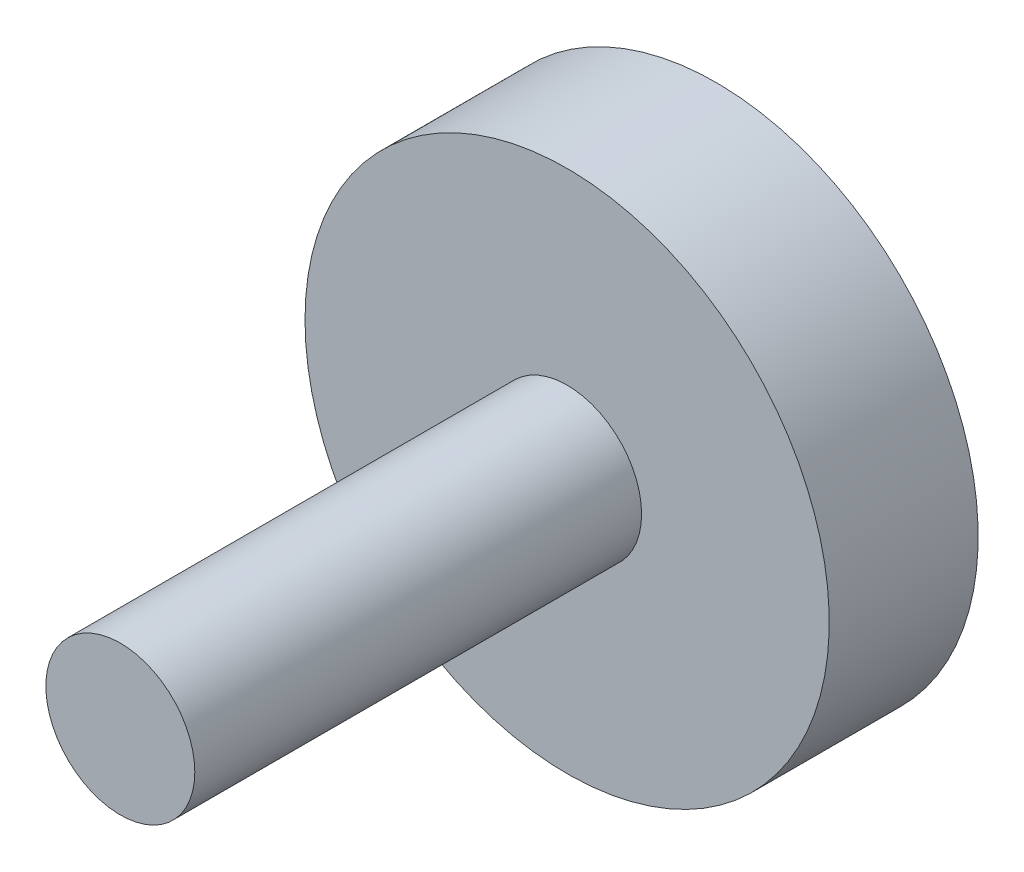
ISO-10303-21;
HEADER;
FILE_DESCRIPTION(('STEP AP214'),'2;1');
FILE_NAME('part.step','',(''),(''),'','','');
FILE_SCHEMA(('AUTOMOTIVE_DESIGN { 1 0 10303 214 1 1 1 1 }'));
ENDSEC;
DATA;
#1=APPLICATION_CONTEXT('core data for automotive mechanical design processes');
#2=APPLICATION_PROTOCOL_DEFINITION('international standard','automotive_design',2000,#1);
#3=PRODUCT_CONTEXT('',#1,'mechanical');
#4=PRODUCT('Part','Part','',(#3));
#5=PRODUCT_RELATED_PRODUCT_CATEGORY('part','',(#4));
#6=PRODUCT_DEFINITION_FORMATION('','',#4);
#7=PRODUCT_DEFINITION_CONTEXT('part definition',#1,'design');
#8=PRODUCT_DEFINITION('design','',#6,#7);
#9=PRODUCT_DEFINITION_SHAPE('','',#8);
#10=(LENGTH_UNIT() NAMED_UNIT(*) SI_UNIT(.MILLI.,.METRE.));
#11=(NAMED_UNIT(*) PLANE_ANGLE_UNIT() SI_UNIT($,.RADIAN.));
#12=(NAMED_UNIT(*) SI_UNIT($,.STERADIAN.) SOLID_ANGLE_UNIT());
#13=UNCERTAINTY_MEASURE_WITH_UNIT(LENGTH_MEASURE(1.E-05),#10,'distance_accuracy_value','');
#14=(GEOMETRIC_REPRESENTATION_CONTEXT(3) GLOBAL_UNCERTAINTY_ASSIGNED_CONTEXT((#13)) GLOBAL_UNIT_ASSIGNED_CONTEXT((#10,
#11,#12)) REPRESENTATION_CONTEXT('',''));
#15=CARTESIAN_POINT('',(0.,0.,0.));
#16=DIRECTION('',(0.,0.,1.));
#17=DIRECTION('',(1.,0.,0.));
#18=AXIS2_PLACEMENT_3D('',#15,#16,#17);
#19=CARTESIAN_POINT('',(0.,0.,30.));
#20=DIRECTION('',(0.,0.,-1.));
#21=DIRECTION('',(-1.,0.,0.));
#22=AXIS2_PLACEMENT_3D('',#19,#20,#21);
#23=CYLINDRICAL_SURFACE('',#22,5.);
#24=CARTESIAN_POINT('',(0.,0.,30.));
#25=DIRECTION('',(0.,0.,1.));
#26=DIRECTION('',(1.,0.,0.));
#27=AXIS2_PLACEMENT_3D('',#24,#25,#26);
#28=CIRCLE('',#27,5.);
#29=CARTESIAN_POINT('',(5.,0.,30.));
#30=VERTEX_POINT('',#29);
#31=EDGE_CURVE('E10',#30,#30,#28,.T.);
#32=ORIENTED_EDGE('',*,*,#31,.F.);
#33=EDGE_LOOP('',(#32));
#34=FACE_BOUND('',#33,.T.);
#35=CARTESIAN_POINT('',(0.,0.,0.));
#36=DIRECTION('',(0.,0.,1.));
#37=DIRECTION('',(1.,0.,0.));
#38=AXIS2_PLACEMENT_3D('',#35,#36,#37);
#39=CIRCLE('',#38,5.);
#40=CARTESIAN_POINT('',(5.,0.,0.));
#41=VERTEX_POINT('',#40);
#42=EDGE_CURVE('E42',#41,#41,#39,.T.);
#43=ORIENTED_EDGE('',*,*,#42,.T.);
#44=EDGE_LOOP('',(#43));
#45=FACE_BOUND('',#44,.T.);
#46=ADVANCED_FACE('F39',(#34,#45),#23,.T.);
#47=CARTESIAN_POINT('',(0.,0.,30.));
#48=DIRECTION('',(0.,0.,1.));
#49=DIRECTION('',(1.,0.,0.));
#50=AXIS2_PLACEMENT_3D('',#47,#48,#49);
#51=PLANE('',#50);
#52=ORIENTED_EDGE('',*,*,#31,.T.);
#53=EDGE_LOOP('',(#52));
#54=FACE_BOUND('',#53,.T.);
#55=ADVANCED_FACE('F62',(#54),#51,.T.);
#56=CARTESIAN_POINT('',(0.,0.,-10.));
#57=DIRECTION('',(0.,0.,1.));
#58=DIRECTION('',(1.,0.,0.));
#59=AXIS2_PLACEMENT_3D('',#56,#57,#58);
#60=CYLINDRICAL_SURFACE('',#59,17.6);
#61=CARTESIAN_POINT('',(0.,0.,-10.));
#62=DIRECTION('',(0.,0.,-1.));
#63=DIRECTION('',(-1.,0.,0.));
#64=AXIS2_PLACEMENT_3D('',#61,#62,#63);
#65=CIRCLE('',#64,17.6);
#66=CARTESIAN_POINT('',(-17.6,0.,-10.));
#67=VERTEX_POINT('',#66);
#68=EDGE_CURVE('E49',#67,#67,#65,.T.);
#69=ORIENTED_EDGE('',*,*,#68,.F.);
#70=EDGE_LOOP('',(#69));
#71=FACE_BOUND('',#70,.T.);
#72=CARTESIAN_POINT('',(0.,0.,0.));
#73=DIRECTION('',(0.,0.,-1.));
#74=DIRECTION('',(-1.,0.,0.));
#75=AXIS2_PLACEMENT_3D('',#72,#73,#74);
#76=CIRCLE('',#75,17.6);
#77=CARTESIAN_POINT('',(-17.6,0.,0.));
#78=VERTEX_POINT('',#77);
#79=EDGE_CURVE('E51',#78,#78,#76,.T.);
#80=ORIENTED_EDGE('',*,*,#79,.T.);
#81=EDGE_LOOP('',(#80));
#82=FACE_BOUND('',#81,.T.);
#83=ADVANCED_FACE('F59',(#71,#82),#60,.T.);
#84=CARTESIAN_POINT('',(0.,0.,-10.));
#85=DIRECTION('',(0.,0.,-1.));
#86=DIRECTION('',(-1.,0.,0.));
#87=AXIS2_PLACEMENT_3D('',#84,#85,#86);
#88=PLANE('',#87);
#89=ORIENTED_EDGE('',*,*,#68,.T.);
#90=EDGE_LOOP('',(#89));
#91=FACE_BOUND('',#90,.T.);
#92=ADVANCED_FACE('F57',(#91),#88,.T.);
#93=CARTESIAN_POINT('',(0.,0.,0.));
#94=DIRECTION('',(0.,0.,-1.));
#95=DIRECTION('',(-1.,0.,0.));
#96=AXIS2_PLACEMENT_3D('',#93,#94,#95);
#97=PLANE('',#96);
#98=ORIENTED_EDGE('',*,*,#42,.F.);
#99=EDGE_LOOP('',(#98));
#100=FACE_BOUND('',#99,.T.);
#101=ORIENTED_EDGE('',*,*,#79,.F.);
#102=EDGE_LOOP('',(#101));
#103=FACE_BOUND('',#102,.T.);
#104=ADVANCED_FACE('F66',(#100,#103),#97,.F.);
#105=CLOSED_SHELL('',(#46,#55,#83,#92,#104));
#106=MANIFOLD_SOLID_BREP('B2',#105);
#107=ADVANCED_BREP_SHAPE_REPRESENTATION('',(#18,#106),#14);
#108=SHAPE_DEFINITION_REPRESENTATION(#9,#107);
ENDSEC;
END-ISO-10303-21;
